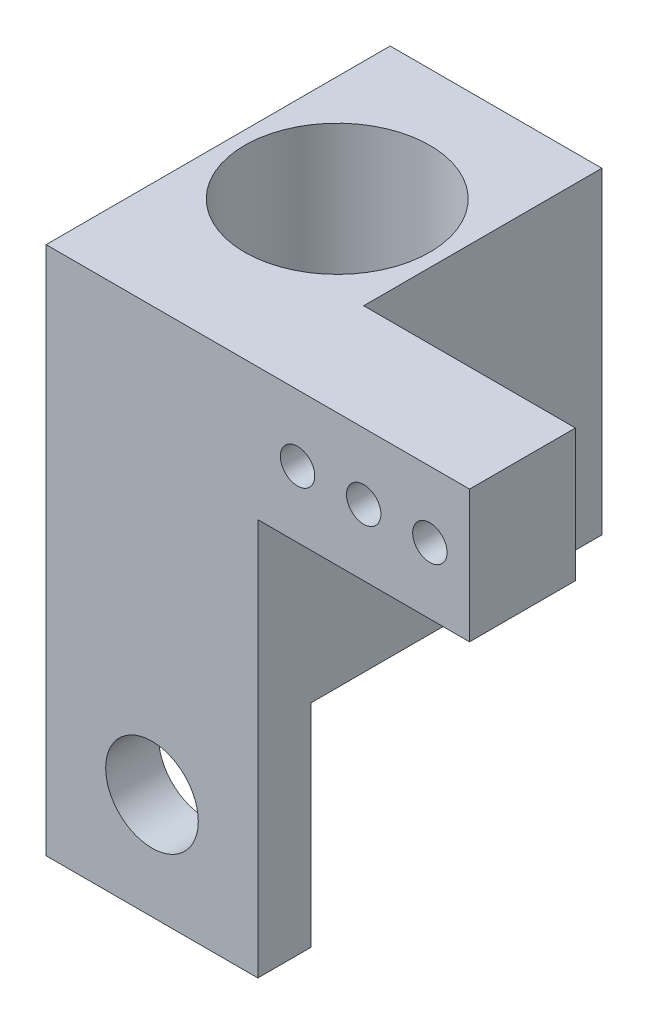
ISO-10303-21;
HEADER;
FILE_DESCRIPTION(('STEP AP214'),'2;1');
FILE_NAME('part.step','',(''),(''),'','','');
FILE_SCHEMA(('AUTOMOTIVE_DESIGN { 1 0 10303 214 1 1 1 1 }'));
ENDSEC;
DATA;
#1=APPLICATION_CONTEXT('core data for automotive mechanical design processes');
#2=APPLICATION_PROTOCOL_DEFINITION('international standard','automotive_design',2000,#1);
#3=PRODUCT_CONTEXT('',#1,'mechanical');
#4=PRODUCT('Part','Part','',(#3));
#5=PRODUCT_RELATED_PRODUCT_CATEGORY('part','',(#4));
#6=PRODUCT_DEFINITION_FORMATION('','',#4);
#7=PRODUCT_DEFINITION_CONTEXT('part definition',#1,'design');
#8=PRODUCT_DEFINITION('design','',#6,#7);
#9=PRODUCT_DEFINITION_SHAPE('','',#8);
#10=(LENGTH_UNIT() NAMED_UNIT(*) SI_UNIT(.MILLI.,.METRE.));
#11=(NAMED_UNIT(*) PLANE_ANGLE_UNIT() SI_UNIT($,.RADIAN.));
#12=(NAMED_UNIT(*) SI_UNIT($,.STERADIAN.) SOLID_ANGLE_UNIT());
#13=UNCERTAINTY_MEASURE_WITH_UNIT(LENGTH_MEASURE(1.E-05),#10,'distance_accuracy_value','');
#14=(GEOMETRIC_REPRESENTATION_CONTEXT(3) GLOBAL_UNCERTAINTY_ASSIGNED_CONTEXT((#13)) GLOBAL_UNIT_ASSIGNED_CONTEXT((#10,
#11,#12)) REPRESENTATION_CONTEXT('',''));
#15=CARTESIAN_POINT('',(0.,0.,0.));
#16=DIRECTION('',(0.,0.,1.));
#17=DIRECTION('',(1.,0.,0.));
#18=AXIS2_PLACEMENT_3D('',#15,#16,#17);
#19=CARTESIAN_POINT('',(-8.,2.,-8.));
#20=DIRECTION('',(-1.,0.,0.));
#21=DIRECTION('',(0.,0.,1.));
#22=AXIS2_PLACEMENT_3D('',#19,#20,#21);
#23=PLANE('',#22);
#24=DIRECTION('',(0.,0.,-1.));
#25=VECTOR('',#24,1.);
#26=CARTESIAN_POINT('',(-8.,4.,-8.));
#27=LINE('',#26,#25);
#28=CARTESIAN_POINT('',(-8.,4.,-0.999999999999996));
#29=VERTEX_POINT('',#28);
#30=CARTESIAN_POINT('',(-8.,4.,-10.));
#31=VERTEX_POINT('',#30);
#32=EDGE_CURVE('E79',#29,#31,#27,.T.);
#33=ORIENTED_EDGE('',*,*,#32,.F.);
#34=DIRECTION('',(0.,-1.,0.));
#35=VECTOR('',#34,1.);
#36=CARTESIAN_POINT('',(-8.,2.,-0.999999999999996));
#37=LINE('',#36,#35);
#38=CARTESIAN_POINT('',(-8.,-1.,-0.999999999999999));
#39=VERTEX_POINT('',#38);
#40=EDGE_CURVE('E42',#29,#39,#37,.T.);
#41=ORIENTED_EDGE('',*,*,#40,.T.);
#42=DIRECTION('',(0.,0.,-1.));
#43=VECTOR('',#42,1.);
#44=CARTESIAN_POINT('',(-8.,-1.,-0.999999999999999));
#45=LINE('',#44,#43);
#46=CARTESIAN_POINT('',(-8.,-1.,3.));
#47=VERTEX_POINT('',#46);
#48=EDGE_CURVE('E146',#47,#39,#45,.T.);
#49=ORIENTED_EDGE('',*,*,#48,.F.);
#50=DIRECTION('',(0.,1.,0.));
#51=VECTOR('',#50,1.);
#52=CARTESIAN_POINT('',(-8.,-8.,3.));
#53=LINE('',#52,#51);
#54=CARTESIAN_POINT('',(-8.,-16.,3.));
#55=VERTEX_POINT('',#54);
#56=EDGE_CURVE('E101',#55,#47,#53,.T.);
#57=ORIENTED_EDGE('',*,*,#56,.F.);
#58=DIRECTION('',(0.,0.,1.));
#59=VECTOR('',#58,1.);
#60=CARTESIAN_POINT('',(-8.,-16.,3.));
#61=LINE('',#60,#59);
#62=CARTESIAN_POINT('',(-8.,-16.,1.));
#63=VERTEX_POINT('',#62);
#64=EDGE_CURVE('E108',#63,#55,#61,.T.);
#65=ORIENTED_EDGE('',*,*,#64,.F.);
#66=DIRECTION('',(0.,1.,0.));
#67=VECTOR('',#66,1.);
#68=CARTESIAN_POINT('',(-8.,-16.,1.));
#69=LINE('',#68,#67);
#70=CARTESIAN_POINT('',(-8.,-8.,1.));
#71=VERTEX_POINT('',#70);
#72=EDGE_CURVE('E112',#63,#71,#69,.T.);
#73=ORIENTED_EDGE('',*,*,#72,.T.);
#74=DIRECTION('',(0.,0.,1.));
#75=VECTOR('',#74,1.);
#76=CARTESIAN_POINT('',(-8.,-8.,-8.));
#77=LINE('',#76,#75);
#78=CARTESIAN_POINT('',(-8.,-8.,-10.));
#79=VERTEX_POINT('',#78);
#80=EDGE_CURVE('E69',#79,#71,#77,.T.);
#81=ORIENTED_EDGE('',*,*,#80,.F.);
#82=DIRECTION('',(0.,-1.,0.));
#83=VECTOR('',#82,1.);
#84=CARTESIAN_POINT('',(-8.,-8.,-10.));
#85=LINE('',#84,#83);
#86=EDGE_CURVE('E140',#31,#79,#85,.T.);
#87=ORIENTED_EDGE('',*,*,#86,.F.);
#88=EDGE_LOOP('',(#33,#41,#49,#57,#65,#73,#81,#87));
#89=FACE_BOUND('',#88,.T.);
#90=ADVANCED_FACE('F33',(#89),#23,.F.);
#91=CARTESIAN_POINT('',(-16.,2.,-8.));
#92=DIRECTION('',(1.,0.,0.));
#93=DIRECTION('',(0.,0.,-1.));
#94=AXIS2_PLACEMENT_3D('',#91,#92,#93);
#95=PLANE('',#94);
#96=DIRECTION('',(0.,0.,1.));
#97=VECTOR('',#96,1.);
#98=CARTESIAN_POINT('',(-16.,4.,-8.));
#99=LINE('',#98,#97);
#100=CARTESIAN_POINT('',(-16.,4.,-10.));
#101=VERTEX_POINT('',#100);
#102=CARTESIAN_POINT('',(-16.,4.,3.));
#103=VERTEX_POINT('',#102);
#104=EDGE_CURVE('E246',#101,#103,#99,.T.);
#105=ORIENTED_EDGE('',*,*,#104,.F.);
#106=DIRECTION('',(0.,1.,0.));
#107=VECTOR('',#106,1.);
#108=CARTESIAN_POINT('',(-16.,-8.,-10.));
#109=LINE('',#108,#107);
#110=CARTESIAN_POINT('',(-16.,-8.,-10.));
#111=VERTEX_POINT('',#110);
#112=EDGE_CURVE('E134',#111,#101,#109,.T.);
#113=ORIENTED_EDGE('',*,*,#112,.F.);
#114=DIRECTION('',(0.,0.,-1.));
#115=VECTOR('',#114,1.);
#116=CARTESIAN_POINT('',(-16.,-8.,-8.));
#117=LINE('',#116,#115);
#118=CARTESIAN_POINT('',(-16.,-8.,0.999999999999999));
#119=VERTEX_POINT('',#118);
#120=EDGE_CURVE('E122',#119,#111,#117,.T.);
#121=ORIENTED_EDGE('',*,*,#120,.F.);
#122=DIRECTION('',(0.,1.,0.));
#123=VECTOR('',#122,1.);
#124=CARTESIAN_POINT('',(-16.,-16.,0.999999999999999));
#125=LINE('',#124,#123);
#126=CARTESIAN_POINT('',(-16.,-16.,0.999999999999999));
#127=VERTEX_POINT('',#126);
#128=EDGE_CURVE('E102',#127,#119,#125,.T.);
#129=ORIENTED_EDGE('',*,*,#128,.F.);
#130=DIRECTION('',(0.,0.,-1.));
#131=VECTOR('',#130,1.);
#132=CARTESIAN_POINT('',(-16.,-16.,3.));
#133=LINE('',#132,#131);
#134=CARTESIAN_POINT('',(-16.,-16.,3.));
#135=VERTEX_POINT('',#134);
#136=EDGE_CURVE('E105',#135,#127,#133,.T.);
#137=ORIENTED_EDGE('',*,*,#136,.F.);
#138=DIRECTION('',(0.,-1.,0.));
#139=VECTOR('',#138,1.);
#140=CARTESIAN_POINT('',(-16.,2.,3.));
#141=LINE('',#140,#139);
#142=EDGE_CURVE('E90',#103,#135,#141,.T.);
#143=ORIENTED_EDGE('',*,*,#142,.F.);
#144=EDGE_LOOP('',(#105,#113,#121,#129,#137,#143));
#145=FACE_BOUND('',#144,.T.);
#146=ADVANCED_FACE('F35',(#145),#95,.F.);
#147=CARTESIAN_POINT('',(0.,2.,0.));
#148=DIRECTION('',(-1.,0.,0.));
#149=DIRECTION('',(0.,0.,1.));
#150=AXIS2_PLACEMENT_3D('',#147,#148,#149);
#151=PLANE('',#150);
#152=DIRECTION('',(0.,1.,0.));
#153=VECTOR('',#152,1.);
#154=CARTESIAN_POINT('',(0.,0.,3.));
#155=LINE('',#154,#153);
#156=CARTESIAN_POINT('',(0.,-1.,3.));
#157=VERTEX_POINT('',#156);
#158=CARTESIAN_POINT('',(0.,4.,3.));
#159=VERTEX_POINT('',#158);
#160=EDGE_CURVE('E220',#157,#159,#155,.T.);
#161=ORIENTED_EDGE('',*,*,#160,.F.);
#162=DIRECTION('',(0.,0.,1.));
#163=VECTOR('',#162,1.);
#164=CARTESIAN_POINT('',(0.,-1.,-0.999999999999999));
#165=LINE('',#164,#163);
#166=CARTESIAN_POINT('',(0.,-1.,-0.999999999999999));
#167=VERTEX_POINT('',#166);
#168=EDGE_CURVE('E152',#167,#157,#165,.T.);
#169=ORIENTED_EDGE('',*,*,#168,.F.);
#170=DIRECTION('',(0.,-1.,0.));
#171=VECTOR('',#170,1.);
#172=CARTESIAN_POINT('',(0.,2.,-0.999999999999999));
#173=LINE('',#172,#171);
#174=CARTESIAN_POINT('',(0.,4.,-0.999999999999999));
#175=VERTEX_POINT('',#174);
#176=EDGE_CURVE('E11',#175,#167,#173,.T.);
#177=ORIENTED_EDGE('',*,*,#176,.F.);
#178=DIRECTION('',(0.,0.,-1.));
#179=VECTOR('',#178,1.);
#180=CARTESIAN_POINT('',(0.,4.,-0.999999999999999));
#181=LINE('',#180,#179);
#182=EDGE_CURVE('E157',#159,#175,#181,.T.);
#183=ORIENTED_EDGE('',*,*,#182,.F.);
#184=EDGE_LOOP('',(#161,#169,#177,#183));
#185=FACE_BOUND('',#184,.T.);
#186=ADVANCED_FACE('F204',(#185),#151,.F.);
#187=CARTESIAN_POINT('',(0.,2.,-0.999999999999999));
#188=DIRECTION('',(0.,0.,1.));
#189=DIRECTION('',(1.,0.,0.));
#190=AXIS2_PLACEMENT_3D('',#187,#188,#189);
#191=PLANE('',#190);
#192=CARTESIAN_POINT('',(-6.5,1.5,-0.999999999999996));
#193=DIRECTION('',(0.,0.,-1.));
#194=DIRECTION('',(-1.,0.,0.));
#195=AXIS2_PLACEMENT_3D('',#192,#193,#194);
#196=CIRCLE('',#195,0.65);
#197=CARTESIAN_POINT('',(-7.15,1.5,-0.999999999999996));
#198=VERTEX_POINT('',#197);
#199=EDGE_CURVE('E171',#198,#198,#196,.T.);
#200=ORIENTED_EDGE('',*,*,#199,.F.);
#201=EDGE_LOOP('',(#200));
#202=FACE_BOUND('',#201,.T.);
#203=CARTESIAN_POINT('',(-4.,1.5,-0.999999999999997));
#204=DIRECTION('',(0.,0.,-1.));
#205=DIRECTION('',(-1.,0.,0.));
#206=AXIS2_PLACEMENT_3D('',#203,#204,#205);
#207=CIRCLE('',#206,0.650000000000001);
#208=CARTESIAN_POINT('',(-4.65,1.5,-0.999999999999997));
#209=VERTEX_POINT('',#208);
#210=EDGE_CURVE('E165',#209,#209,#207,.T.);
#211=ORIENTED_EDGE('',*,*,#210,.F.);
#212=EDGE_LOOP('',(#211));
#213=FACE_BOUND('',#212,.T.);
#214=CARTESIAN_POINT('',(-1.5,1.5,-0.999999999999999));
#215=DIRECTION('',(0.,0.,-1.));
#216=DIRECTION('',(-1.,0.,0.));
#217=AXIS2_PLACEMENT_3D('',#214,#215,#216);
#218=CIRCLE('',#217,0.65);
#219=CARTESIAN_POINT('',(-2.15,1.5,-0.999999999999998));
#220=VERTEX_POINT('',#219);
#221=EDGE_CURVE('E158',#220,#220,#218,.T.);
#222=ORIENTED_EDGE('',*,*,#221,.F.);
#223=EDGE_LOOP('',(#222));
#224=FACE_BOUND('',#223,.T.);
#225=ORIENTED_EDGE('',*,*,#176,.T.);
#226=DIRECTION('',(1.,0.,0.));
#227=VECTOR('',#226,1.);
#228=CARTESIAN_POINT('',(0.,-1.,-0.999999999999999));
#229=LINE('',#228,#227);
#230=EDGE_CURVE('E143',#39,#167,#229,.T.);
#231=ORIENTED_EDGE('',*,*,#230,.F.);
#232=ORIENTED_EDGE('',*,*,#40,.F.);
#233=DIRECTION('',(-1.,0.,0.));
#234=VECTOR('',#233,1.);
#235=CARTESIAN_POINT('',(-8.,4.,-0.999999999999996));
#236=LINE('',#235,#234);
#237=EDGE_CURVE('E155',#175,#29,#236,.T.);
#238=ORIENTED_EDGE('',*,*,#237,.F.);
#239=EDGE_LOOP('',(#225,#231,#232,#238));
#240=FACE_BOUND('',#239,.T.);
#241=ADVANCED_FACE('F209',(#202,#213,#224,#240),#191,.F.);
#242=CARTESIAN_POINT('',(0.,4.,0.));
#243=DIRECTION('',(0.,1.,0.));
#244=DIRECTION('',(0.,0.,1.));
#245=AXIS2_PLACEMENT_3D('',#242,#243,#244);
#246=PLANE('',#245);
#247=CARTESIAN_POINT('',(-12.,4.,-4.));
#248=DIRECTION('',(0.,1.,0.));
#249=DIRECTION('',(0.,0.,1.));
#250=AXIS2_PLACEMENT_3D('',#247,#248,#249);
#251=CIRCLE('',#250,3.5);
#252=CARTESIAN_POINT('',(-12.,4.,-0.499999999999998));
#253=VERTEX_POINT('',#252);
#254=EDGE_CURVE('E260',#253,#253,#251,.T.);
#255=ORIENTED_EDGE('',*,*,#254,.F.);
#256=EDGE_LOOP('',(#255));
#257=FACE_BOUND('',#256,.T.);
#258=ORIENTED_EDGE('',*,*,#104,.T.);
#259=DIRECTION('',(1.,0.,0.));
#260=VECTOR('',#259,1.);
#261=CARTESIAN_POINT('',(0.,4.,3.));
#262=LINE('',#261,#260);
#263=EDGE_CURVE('E98',#103,#159,#262,.T.);
#264=ORIENTED_EDGE('',*,*,#263,.T.);
#265=ORIENTED_EDGE('',*,*,#182,.T.);
#266=ORIENTED_EDGE('',*,*,#237,.T.);
#267=ORIENTED_EDGE('',*,*,#32,.T.);
#268=DIRECTION('',(1.,0.,0.));
#269=VECTOR('',#268,1.);
#270=CARTESIAN_POINT('',(-8.,4.,-10.));
#271=LINE('',#270,#269);
#272=EDGE_CURVE('E121',#101,#31,#271,.T.);
#273=ORIENTED_EDGE('',*,*,#272,.F.);
#274=EDGE_LOOP('',(#258,#264,#265,#266,#267,#273));
#275=FACE_BOUND('',#274,.T.);
#276=ADVANCED_FACE('F207',(#257,#275),#246,.T.);
#277=CARTESIAN_POINT('',(0.,-8.,0.));
#278=DIRECTION('',(0.,-1.,0.));
#279=DIRECTION('',(0.,0.,-1.));
#280=AXIS2_PLACEMENT_3D('',#277,#278,#279);
#281=PLANE('',#280);
#282=DIRECTION('',(1.,0.,0.));
#283=VECTOR('',#282,1.);
#284=CARTESIAN_POINT('',(-8.,-8.,1.));
#285=LINE('',#284,#283);
#286=EDGE_CURVE('E50',#119,#71,#285,.T.);
#287=ORIENTED_EDGE('',*,*,#286,.F.);
#288=ORIENTED_EDGE('',*,*,#120,.T.);
#289=DIRECTION('',(-1.,0.,0.));
#290=VECTOR('',#289,1.);
#291=CARTESIAN_POINT('',(-8.,-8.,-10.));
#292=LINE('',#291,#290);
#293=EDGE_CURVE('E137',#79,#111,#292,.T.);
#294=ORIENTED_EDGE('',*,*,#293,.F.);
#295=ORIENTED_EDGE('',*,*,#80,.T.);
#296=EDGE_LOOP('',(#287,#288,#294,#295));
#297=FACE_BOUND('',#296,.T.);
#298=CARTESIAN_POINT('',(-10.5,-8.,-4.));
#299=DIRECTION('',(0.,-1.,0.));
#300=DIRECTION('',(0.,0.,-1.));
#301=AXIS2_PLACEMENT_3D('',#298,#299,#300);
#302=CIRCLE('',#301,0.649999999999999);
#303=CARTESIAN_POINT('',(-10.5,-8.,-4.65));
#304=VERTEX_POINT('',#303);
#305=EDGE_CURVE('E228',#304,#304,#302,.F.);
#306=ORIENTED_EDGE('',*,*,#305,.T.);
#307=EDGE_LOOP('',(#306));
#308=FACE_BOUND('',#307,.T.);
#309=CARTESIAN_POINT('',(-13.5,-8.,-4.));
#310=DIRECTION('',(0.,-1.,0.));
#311=DIRECTION('',(0.,0.,-1.));
#312=AXIS2_PLACEMENT_3D('',#309,#310,#311);
#313=CIRCLE('',#312,0.649999999999999);
#314=CARTESIAN_POINT('',(-13.5,-8.,-4.65));
#315=VERTEX_POINT('',#314);
#316=EDGE_CURVE('E266',#315,#315,#313,.F.);
#317=ORIENTED_EDGE('',*,*,#316,.T.);
#318=EDGE_LOOP('',(#317));
#319=FACE_BOUND('',#318,.T.);
#320=ADVANCED_FACE('F243',(#297,#308,#319),#281,.T.);
#321=CARTESIAN_POINT('',(-12.,-6.,-4.));
#322=DIRECTION('',(0.,1.,0.));
#323=DIRECTION('',(0.,0.,1.));
#324=AXIS2_PLACEMENT_3D('',#321,#322,#323);
#325=CYLINDRICAL_SURFACE('',#324,3.5);
#326=CARTESIAN_POINT('',(-12.,-6.,-4.));
#327=DIRECTION('',(0.,1.,0.));
#328=DIRECTION('',(0.,0.,1.));
#329=AXIS2_PLACEMENT_3D('',#326,#327,#328);
#330=CIRCLE('',#329,3.5);
#331=CARTESIAN_POINT('',(-12.,-6.,-0.499999999999998));
#332=VERTEX_POINT('',#331);
#333=EDGE_CURVE('E257',#332,#332,#330,.T.);
#334=ORIENTED_EDGE('',*,*,#333,.F.);
#335=EDGE_LOOP('',(#334));
#336=FACE_BOUND('',#335,.T.);
#337=ORIENTED_EDGE('',*,*,#254,.T.);
#338=EDGE_LOOP('',(#337));
#339=FACE_BOUND('',#338,.T.);
#340=ADVANCED_FACE('F282',(#336,#339),#325,.F.);
#341=CARTESIAN_POINT('',(-12.,-6.,-4.));
#342=DIRECTION('',(0.,1.,0.));
#343=DIRECTION('',(0.,0.,1.));
#344=AXIS2_PLACEMENT_3D('',#341,#342,#343);
#345=PLANE('',#344);
#346=CARTESIAN_POINT('',(-10.5,-6.,-4.));
#347=DIRECTION('',(0.,1.,0.));
#348=DIRECTION('',(0.,0.,1.));
#349=AXIS2_PLACEMENT_3D('',#346,#347,#348);
#350=CIRCLE('',#349,0.649999999999999);
#351=CARTESIAN_POINT('',(-10.5,-6.,-3.35));
#352=VERTEX_POINT('',#351);
#353=EDGE_CURVE('E269',#352,#352,#350,.T.);
#354=ORIENTED_EDGE('',*,*,#353,.F.);
#355=EDGE_LOOP('',(#354));
#356=FACE_BOUND('',#355,.T.);
#357=CARTESIAN_POINT('',(-13.5,-6.,-4.));
#358=DIRECTION('',(0.,1.,0.));
#359=DIRECTION('',(0.,0.,1.));
#360=AXIS2_PLACEMENT_3D('',#357,#358,#359);
#361=CIRCLE('',#360,0.649999999999999);
#362=CARTESIAN_POINT('',(-13.5,-6.,-3.35));
#363=VERTEX_POINT('',#362);
#364=EDGE_CURVE('E263',#363,#363,#361,.T.);
#365=ORIENTED_EDGE('',*,*,#364,.F.);
#366=EDGE_LOOP('',(#365));
#367=FACE_BOUND('',#366,.T.);
#368=ORIENTED_EDGE('',*,*,#333,.T.);
#369=EDGE_LOOP('',(#368));
#370=FACE_BOUND('',#369,.T.);
#371=ADVANCED_FACE('F278',(#356,#367,#370),#345,.T.);
#372=CARTESIAN_POINT('',(-13.5,-8.001025,-4.));
#373=DIRECTION('',(0.,1.,0.));
#374=DIRECTION('',(0.,0.,1.));
#375=AXIS2_PLACEMENT_3D('',#372,#373,#374);
#376=CYLINDRICAL_SURFACE('',#375,0.649999999999999);
#377=ORIENTED_EDGE('',*,*,#316,.F.);
#378=EDGE_LOOP('',(#377));
#379=FACE_BOUND('',#378,.T.);
#380=ORIENTED_EDGE('',*,*,#364,.T.);
#381=EDGE_LOOP('',(#380));
#382=FACE_BOUND('',#381,.T.);
#383=ADVANCED_FACE('F281',(#379,#382),#376,.F.);
#384=CARTESIAN_POINT('',(-10.5,-8.001025,-4.));
#385=DIRECTION('',(0.,1.,0.));
#386=DIRECTION('',(0.,0.,1.));
#387=AXIS2_PLACEMENT_3D('',#384,#385,#386);
#388=CYLINDRICAL_SURFACE('',#387,0.649999999999999);
#389=ORIENTED_EDGE('',*,*,#305,.F.);
#390=EDGE_LOOP('',(#389));
#391=FACE_BOUND('',#390,.T.);
#392=ORIENTED_EDGE('',*,*,#353,.T.);
#393=EDGE_LOOP('',(#392));
#394=FACE_BOUND('',#393,.T.);
#395=ADVANCED_FACE('F196',(#391,#394),#388,.F.);
#396=CARTESIAN_POINT('',(0.,0.,3.));
#397=DIRECTION('',(0.,0.,1.));
#398=DIRECTION('',(1.,0.,0.));
#399=AXIS2_PLACEMENT_3D('',#396,#397,#398);
#400=PLANE('',#399);
#401=CARTESIAN_POINT('',(-12.,-12.,3.));
#402=DIRECTION('',(0.,0.,1.));
#403=DIRECTION('',(1.,0.,0.));
#404=AXIS2_PLACEMENT_3D('',#401,#402,#403);
#405=CIRCLE('',#404,1.75);
#406=CARTESIAN_POINT('',(-10.25,-12.,3.));
#407=VERTEX_POINT('',#406);
#408=EDGE_CURVE('E180',#407,#407,#405,.F.);
#409=ORIENTED_EDGE('',*,*,#408,.T.);
#410=EDGE_LOOP('',(#409));
#411=FACE_BOUND('',#410,.T.);
#412=CARTESIAN_POINT('',(-6.5,1.5,3.));
#413=DIRECTION('',(0.,0.,1.));
#414=DIRECTION('',(1.,0.,0.));
#415=AXIS2_PLACEMENT_3D('',#412,#413,#414);
#416=CIRCLE('',#415,0.65);
#417=CARTESIAN_POINT('',(-5.85,1.5,3.));
#418=VERTEX_POINT('',#417);
#419=EDGE_CURVE('E174',#418,#418,#416,.F.);
#420=ORIENTED_EDGE('',*,*,#419,.T.);
#421=EDGE_LOOP('',(#420));
#422=FACE_BOUND('',#421,.T.);
#423=CARTESIAN_POINT('',(-4.,1.5,3.));
#424=DIRECTION('',(0.,0.,1.));
#425=DIRECTION('',(1.,0.,0.));
#426=AXIS2_PLACEMENT_3D('',#423,#424,#425);
#427=CIRCLE('',#426,0.650000000000001);
#428=CARTESIAN_POINT('',(-3.35,1.5,3.));
#429=VERTEX_POINT('',#428);
#430=EDGE_CURVE('E168',#429,#429,#427,.F.);
#431=ORIENTED_EDGE('',*,*,#430,.T.);
#432=EDGE_LOOP('',(#431));
#433=FACE_BOUND('',#432,.T.);
#434=CARTESIAN_POINT('',(-1.5,1.5,3.));
#435=DIRECTION('',(0.,0.,1.));
#436=DIRECTION('',(1.,0.,0.));
#437=AXIS2_PLACEMENT_3D('',#434,#435,#436);
#438=CIRCLE('',#437,0.65);
#439=CARTESIAN_POINT('',(-0.849999999999999,1.5,3.));
#440=VERTEX_POINT('',#439);
#441=EDGE_CURVE('E162',#440,#440,#438,.F.);
#442=ORIENTED_EDGE('',*,*,#441,.T.);
#443=EDGE_LOOP('',(#442));
#444=FACE_BOUND('',#443,.T.);
#445=ORIENTED_EDGE('',*,*,#160,.T.);
#446=ORIENTED_EDGE('',*,*,#263,.F.);
#447=ORIENTED_EDGE('',*,*,#142,.T.);
#448=DIRECTION('',(-1.,0.,0.));
#449=VECTOR('',#448,1.);
#450=CARTESIAN_POINT('',(-8.,-16.,3.));
#451=LINE('',#450,#449);
#452=EDGE_CURVE('E95',#55,#135,#451,.T.);
#453=ORIENTED_EDGE('',*,*,#452,.F.);
#454=ORIENTED_EDGE('',*,*,#56,.T.);
#455=DIRECTION('',(-1.,0.,0.));
#456=VECTOR('',#455,1.);
#457=CARTESIAN_POINT('',(0.,-1.,3.));
#458=LINE('',#457,#456);
#459=EDGE_CURVE('E149',#157,#47,#458,.T.);
#460=ORIENTED_EDGE('',*,*,#459,.F.);
#461=EDGE_LOOP('',(#445,#446,#447,#453,#454,#460));
#462=FACE_BOUND('',#461,.T.);
#463=ADVANCED_FACE('F93',(#411,#422,#433,#444,#462),#400,.T.);
#464=CARTESIAN_POINT('',(-8.,-16.,1.));
#465=DIRECTION('',(0.,0.,1.));
#466=DIRECTION('',(1.,0.,0.));
#467=AXIS2_PLACEMENT_3D('',#464,#465,#466);
#468=PLANE('',#467);
#469=CARTESIAN_POINT('',(-12.,-12.,1.));
#470=DIRECTION('',(0.,0.,-1.));
#471=DIRECTION('',(-1.,0.,0.));
#472=AXIS2_PLACEMENT_3D('',#469,#470,#471);
#473=CIRCLE('',#472,1.75);
#474=CARTESIAN_POINT('',(-13.75,-12.,0.999999999999999));
#475=VERTEX_POINT('',#474);
#476=EDGE_CURVE('E177',#475,#475,#473,.T.);
#477=ORIENTED_EDGE('',*,*,#476,.F.);
#478=EDGE_LOOP('',(#477));
#479=FACE_BOUND('',#478,.T.);
#480=ORIENTED_EDGE('',*,*,#286,.T.);
#481=ORIENTED_EDGE('',*,*,#72,.F.);
#482=DIRECTION('',(1.,0.,0.));
#483=VECTOR('',#482,1.);
#484=CARTESIAN_POINT('',(-8.,-16.,1.));
#485=LINE('',#484,#483);
#486=EDGE_CURVE('E59',#127,#63,#485,.T.);
#487=ORIENTED_EDGE('',*,*,#486,.F.);
#488=ORIENTED_EDGE('',*,*,#128,.T.);
#489=EDGE_LOOP('',(#480,#481,#487,#488));
#490=FACE_BOUND('',#489,.T.);
#491=ADVANCED_FACE('F129',(#479,#490),#468,.F.);
#492=CARTESIAN_POINT('',(0.,-16.,0.));
#493=DIRECTION('',(0.,1.,0.));
#494=DIRECTION('',(0.,0.,1.));
#495=AXIS2_PLACEMENT_3D('',#492,#493,#494);
#496=PLANE('',#495);
#497=ORIENTED_EDGE('',*,*,#64,.T.);
#498=ORIENTED_EDGE('',*,*,#452,.T.);
#499=ORIENTED_EDGE('',*,*,#136,.T.);
#500=ORIENTED_EDGE('',*,*,#486,.T.);
#501=EDGE_LOOP('',(#497,#498,#499,#500));
#502=FACE_BOUND('',#501,.T.);
#503=ADVANCED_FACE('F104',(#502),#496,.F.);
#504=CARTESIAN_POINT('',(0.,0.,-10.));
#505=DIRECTION('',(0.,0.,1.));
#506=DIRECTION('',(1.,0.,0.));
#507=AXIS2_PLACEMENT_3D('',#504,#505,#506);
#508=PLANE('',#507);
#509=ORIENTED_EDGE('',*,*,#86,.T.);
#510=ORIENTED_EDGE('',*,*,#293,.T.);
#511=ORIENTED_EDGE('',*,*,#112,.T.);
#512=ORIENTED_EDGE('',*,*,#272,.T.);
#513=EDGE_LOOP('',(#509,#510,#511,#512));
#514=FACE_BOUND('',#513,.T.);
#515=ADVANCED_FACE('F194',(#514),#508,.F.);
#516=CARTESIAN_POINT('',(0.,-1.,0.));
#517=DIRECTION('',(0.,-1.,0.));
#518=DIRECTION('',(0.,0.,-1.));
#519=AXIS2_PLACEMENT_3D('',#516,#517,#518);
#520=PLANE('',#519);
#521=ORIENTED_EDGE('',*,*,#168,.T.);
#522=ORIENTED_EDGE('',*,*,#459,.T.);
#523=ORIENTED_EDGE('',*,*,#48,.T.);
#524=ORIENTED_EDGE('',*,*,#230,.T.);
#525=EDGE_LOOP('',(#521,#522,#523,#524));
#526=FACE_BOUND('',#525,.T.);
#527=ADVANCED_FACE('F231',(#526),#520,.T.);
#528=CARTESIAN_POINT('',(-1.5,1.5,3.001));
#529=DIRECTION('',(0.,0.,-1.));
#530=DIRECTION('',(-1.,0.,0.));
#531=AXIS2_PLACEMENT_3D('',#528,#529,#530);
#532=CYLINDRICAL_SURFACE('',#531,0.65);
#533=ORIENTED_EDGE('',*,*,#441,.F.);
#534=EDGE_LOOP('',(#533));
#535=FACE_BOUND('',#534,.T.);
#536=ORIENTED_EDGE('',*,*,#221,.T.);
#537=EDGE_LOOP('',(#536));
#538=FACE_BOUND('',#537,.T.);
#539=ADVANCED_FACE('F352',(#535,#538),#532,.F.);
#540=CARTESIAN_POINT('',(-4.,1.5,3.001));
#541=DIRECTION('',(0.,0.,-1.));
#542=DIRECTION('',(-1.,0.,0.));
#543=AXIS2_PLACEMENT_3D('',#540,#541,#542);
#544=CYLINDRICAL_SURFACE('',#543,0.650000000000001);
#545=ORIENTED_EDGE('',*,*,#430,.F.);
#546=EDGE_LOOP('',(#545));
#547=FACE_BOUND('',#546,.T.);
#548=ORIENTED_EDGE('',*,*,#210,.T.);
#549=EDGE_LOOP('',(#548));
#550=FACE_BOUND('',#549,.T.);
#551=ADVANCED_FACE('F347',(#547,#550),#544,.F.);
#552=CARTESIAN_POINT('',(-6.5,1.5,3.001));
#553=DIRECTION('',(0.,0.,-1.));
#554=DIRECTION('',(-1.,0.,0.));
#555=AXIS2_PLACEMENT_3D('',#552,#553,#554);
#556=CYLINDRICAL_SURFACE('',#555,0.65);
#557=ORIENTED_EDGE('',*,*,#419,.F.);
#558=EDGE_LOOP('',(#557));
#559=FACE_BOUND('',#558,.T.);
#560=ORIENTED_EDGE('',*,*,#199,.T.);
#561=EDGE_LOOP('',(#560));
#562=FACE_BOUND('',#561,.T.);
#563=ADVANCED_FACE('F325',(#559,#562),#556,.F.);
#564=CARTESIAN_POINT('',(-12.,-12.,3.001));
#565=DIRECTION('',(0.,0.,-1.));
#566=DIRECTION('',(-1.,0.,0.));
#567=AXIS2_PLACEMENT_3D('',#564,#565,#566);
#568=CYLINDRICAL_SURFACE('',#567,1.75);
#569=ORIENTED_EDGE('',*,*,#408,.F.);
#570=EDGE_LOOP('',(#569));
#571=FACE_BOUND('',#570,.T.);
#572=ORIENTED_EDGE('',*,*,#476,.T.);
#573=EDGE_LOOP('',(#572));
#574=FACE_BOUND('',#573,.T.);
#575=ADVANCED_FACE('F186',(#571,#574),#568,.F.);
#576=CLOSED_SHELL('',(#90,#146,#186,#241,#276,#320,#340,#371,#383,#395,#463,#491,#503,#515,#527,
#539,#551,#563,#575));
#577=MANIFOLD_SOLID_BREP('B2',#576);
#578=ADVANCED_BREP_SHAPE_REPRESENTATION('',(#18,#577),#14);
#579=SHAPE_DEFINITION_REPRESENTATION(#9,#578);
ENDSEC;
END-ISO-10303-21;
